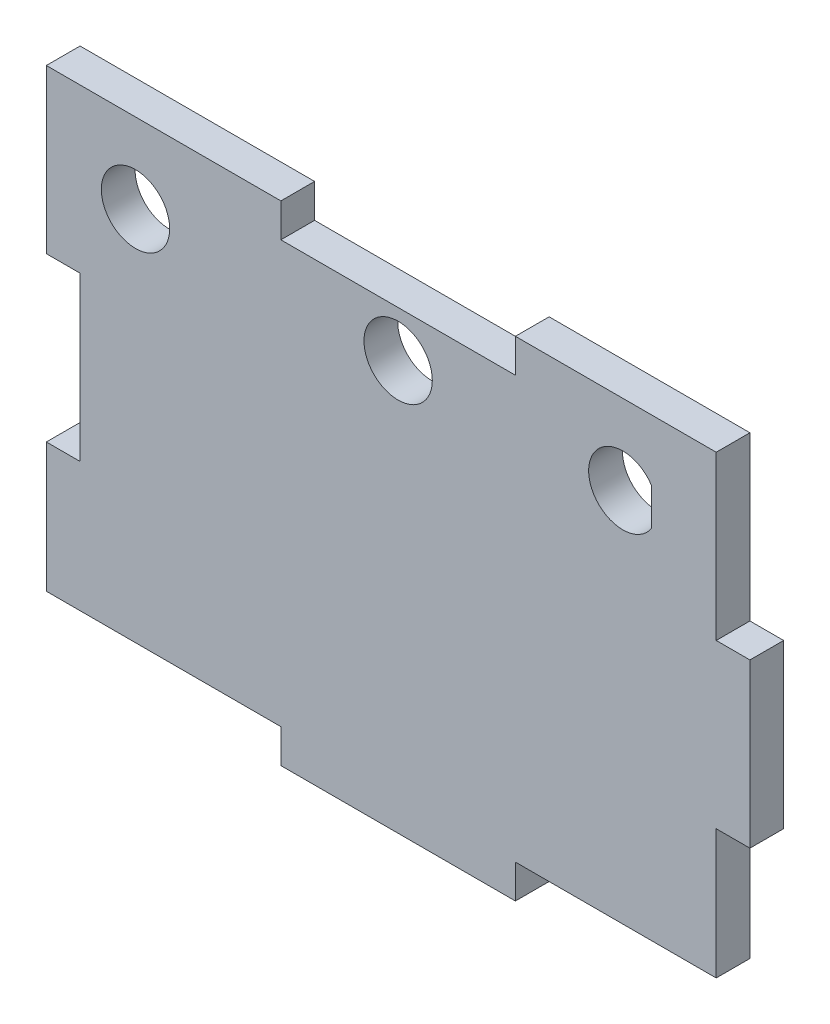
ISO-10303-21;
HEADER;
FILE_DESCRIPTION(('STEP AP214'),'2;1');
FILE_NAME('part.step','',(''),(''),'','','');
FILE_SCHEMA(('AUTOMOTIVE_DESIGN { 1 0 10303 214 1 1 1 1 }'));
ENDSEC;
DATA;
#1=APPLICATION_CONTEXT('core data for automotive mechanical design processes');
#2=APPLICATION_PROTOCOL_DEFINITION('international standard','automotive_design',2000,#1);
#3=PRODUCT_CONTEXT('',#1,'mechanical');
#4=PRODUCT('Part','Part','',(#3));
#5=PRODUCT_RELATED_PRODUCT_CATEGORY('part','',(#4));
#6=PRODUCT_DEFINITION_FORMATION('','',#4);
#7=PRODUCT_DEFINITION_CONTEXT('part definition',#1,'design');
#8=PRODUCT_DEFINITION('design','',#6,#7);
#9=PRODUCT_DEFINITION_SHAPE('','',#8);
#10=(LENGTH_UNIT() NAMED_UNIT(*) SI_UNIT(.MILLI.,.METRE.));
#11=(NAMED_UNIT(*) PLANE_ANGLE_UNIT() SI_UNIT($,.RADIAN.));
#12=(NAMED_UNIT(*) SI_UNIT($,.STERADIAN.) SOLID_ANGLE_UNIT());
#13=UNCERTAINTY_MEASURE_WITH_UNIT(LENGTH_MEASURE(1.E-05),#10,'distance_accuracy_value','');
#14=(GEOMETRIC_REPRESENTATION_CONTEXT(3) GLOBAL_UNCERTAINTY_ASSIGNED_CONTEXT((#13)) GLOBAL_UNIT_ASSIGNED_CONTEXT((#10,
#11,#12)) REPRESENTATION_CONTEXT('',''));
#15=CARTESIAN_POINT('',(0.,0.,0.));
#16=DIRECTION('',(0.,0.,1.));
#17=DIRECTION('',(1.,0.,0.));
#18=AXIS2_PLACEMENT_3D('',#15,#16,#17);
#19=CARTESIAN_POINT('',(60.4012,-41.9862,5.7912));
#20=DIRECTION('',(-1.,0.,0.));
#21=DIRECTION('',(0.,0.,1.));
#22=AXIS2_PLACEMENT_3D('',#19,#20,#21);
#23=PLANE('',#22);
#24=DIRECTION('',(0.,0.,1.));
#25=VECTOR('',#24,1.);
#26=CARTESIAN_POINT('',(60.4011999999999,-13.9954,5.79120000000084));
#27=LINE('',#26,#25);
#28=CARTESIAN_POINT('',(60.4011999999999,-13.9954,8.46545056276682E-13));
#29=VERTEX_POINT('',#28);
#30=CARTESIAN_POINT('',(60.4011999999999,-13.9954,5.79120000000084));
#31=VERTEX_POINT('',#30);
#32=EDGE_CURVE('E217',#29,#31,#27,.T.);
#33=ORIENTED_EDGE('',*,*,#32,.F.);
#34=DIRECTION('',(0.,1.,0.));
#35=VECTOR('',#34,1.);
#36=CARTESIAN_POINT('',(60.4012,-41.9862,0.));
#37=LINE('',#36,#35);
#38=CARTESIAN_POINT('',(60.4012,13.9954,0.));
#39=VERTEX_POINT('',#38);
#40=EDGE_CURVE('E319',#29,#39,#37,.T.);
#41=ORIENTED_EDGE('',*,*,#40,.T.);
#42=DIRECTION('',(0.,0.,-1.));
#43=VECTOR('',#42,1.);
#44=CARTESIAN_POINT('',(60.4011999999999,13.9954,5.79120000000083));
#45=LINE('',#44,#43);
#46=CARTESIAN_POINT('',(60.4011999999999,13.9954,5.79120000000083));
#47=VERTEX_POINT('',#46);
#48=EDGE_CURVE('E215',#47,#39,#45,.T.);
#49=ORIENTED_EDGE('',*,*,#48,.F.);
#50=DIRECTION('',(0.,1.,0.));
#51=VECTOR('',#50,1.);
#52=CARTESIAN_POINT('',(60.4012,-41.9862,5.7912));
#53=LINE('',#52,#51);
#54=EDGE_CURVE('E326',#31,#47,#53,.T.);
#55=ORIENTED_EDGE('',*,*,#54,.F.);
#56=EDGE_LOOP('',(#33,#41,#49,#55));
#57=FACE_BOUND('',#56,.T.);
#58=ADVANCED_FACE('F35',(#57),#23,.F.);
#59=CARTESIAN_POINT('',(-60.4012,41.9862,5.7912));
#60=DIRECTION('',(0.,-1.,0.));
#61=DIRECTION('',(0.,0.,-1.));
#62=AXIS2_PLACEMENT_3D('',#59,#60,#61);
#63=PLANE('',#62);
#64=DIRECTION('',(0.,0.,-1.));
#65=VECTOR('',#64,1.);
#66=CARTESIAN_POINT('',(54.6099999999999,41.9862,5.79120000000082));
#67=LINE('',#66,#65);
#68=CARTESIAN_POINT('',(54.6099999999999,41.9862,5.79120000000082));
#69=VERTEX_POINT('',#68);
#70=CARTESIAN_POINT('',(54.6099999999999,41.9862,0.));
#71=VERTEX_POINT('',#70);
#72=EDGE_CURVE('E238',#69,#71,#67,.T.);
#73=ORIENTED_EDGE('',*,*,#72,.T.);
#74=DIRECTION('',(-1.,0.,0.));
#75=VECTOR('',#74,1.);
#76=CARTESIAN_POINT('',(-60.4012,41.9862,0.));
#77=LINE('',#76,#75);
#78=CARTESIAN_POINT('',(20.1337333333333,41.9862,0.));
#79=VERTEX_POINT('',#78);
#80=EDGE_CURVE('E344',#71,#79,#77,.T.);
#81=ORIENTED_EDGE('',*,*,#80,.T.);
#82=DIRECTION('',(0.,0.,1.));
#83=VECTOR('',#82,1.);
#84=CARTESIAN_POINT('',(20.1337333333333,41.9862,0.));
#85=LINE('',#84,#83);
#86=CARTESIAN_POINT('',(20.1337333333333,41.9862,5.7912));
#87=VERTEX_POINT('',#86);
#88=EDGE_CURVE('E320',#79,#87,#85,.T.);
#89=ORIENTED_EDGE('',*,*,#88,.T.);
#90=DIRECTION('',(-1.,0.,0.));
#91=VECTOR('',#90,1.);
#92=CARTESIAN_POINT('',(-60.4012,41.9862,5.7912));
#93=LINE('',#92,#91);
#94=EDGE_CURVE('E331',#69,#87,#93,.T.);
#95=ORIENTED_EDGE('',*,*,#94,.F.);
#96=EDGE_LOOP('',(#73,#81,#89,#95));
#97=FACE_BOUND('',#96,.T.);
#98=ADVANCED_FACE('F419',(#97),#63,.F.);
#99=CARTESIAN_POINT('',(-60.4012,-41.9862,5.7912));
#100=DIRECTION('',(0.,1.,0.));
#101=DIRECTION('',(0.,0.,1.));
#102=AXIS2_PLACEMENT_3D('',#99,#100,#101);
#103=PLANE('',#102);
#104=DIRECTION('',(0.,0.,1.));
#105=VECTOR('',#104,1.);
#106=CARTESIAN_POINT('',(20.1337333333323,-41.9862000000004,5.791200000001));
#107=LINE('',#106,#105);
#108=CARTESIAN_POINT('',(20.1337333333323,-41.9862000000004,9.95731275210687E-13));
#109=VERTEX_POINT('',#108);
#110=CARTESIAN_POINT('',(20.1337333333323,-41.9862000000004,5.79120000000099));
#111=VERTEX_POINT('',#110);
#112=EDGE_CURVE('E248',#109,#111,#107,.T.);
#113=ORIENTED_EDGE('',*,*,#112,.T.);
#114=DIRECTION('',(1.,0.,0.));
#115=VECTOR('',#114,1.);
#116=CARTESIAN_POINT('',(-60.4012,-41.9862,5.7912));
#117=LINE('',#116,#115);
#118=CARTESIAN_POINT('',(-20.1337333333344,-41.9862000000003,5.79120000000089));
#119=VERTEX_POINT('',#118);
#120=EDGE_CURVE('E337',#119,#111,#117,.T.);
#121=ORIENTED_EDGE('',*,*,#120,.F.);
#122=DIRECTION('',(0.,0.,-1.));
#123=VECTOR('',#122,1.);
#124=CARTESIAN_POINT('',(-20.1337333333344,-41.9862000000003,5.7912000000009));
#125=LINE('',#124,#123);
#126=CARTESIAN_POINT('',(-20.1337333333344,-41.9862000000003,8.98586760555986E-13));
#127=VERTEX_POINT('',#126);
#128=EDGE_CURVE('E244',#119,#127,#125,.T.);
#129=ORIENTED_EDGE('',*,*,#128,.T.);
#130=DIRECTION('',(1.,0.,0.));
#131=VECTOR('',#130,1.);
#132=CARTESIAN_POINT('',(-60.4012,-41.9862,0.));
#133=LINE('',#132,#131);
#134=EDGE_CURVE('E330',#127,#109,#133,.T.);
#135=ORIENTED_EDGE('',*,*,#134,.T.);
#136=EDGE_LOOP('',(#113,#121,#129,#135));
#137=FACE_BOUND('',#136,.T.);
#138=ADVANCED_FACE('F378',(#137),#103,.F.);
#139=CARTESIAN_POINT('',(0.,0.,5.7912));
#140=DIRECTION('',(0.,0.,-1.));
#141=DIRECTION('',(-1.,0.,0.));
#142=AXIS2_PLACEMENT_3D('',#139,#140,#141);
#143=PLANE('',#142);
#144=DIRECTION('',(0.,1.,0.));
#145=VECTOR('',#144,1.);
#146=CARTESIAN_POINT('',(43.4702699731941,31.5383217777612,5.7912));
#147=LINE('',#146,#145);
#148=CARTESIAN_POINT('',(43.4702699731941,25.0516670127841,5.7912));
#149=VERTEX_POINT('',#148);
#150=CARTESIAN_POINT('',(43.4702699731941,31.5383217777612,5.7912));
#151=VERTEX_POINT('',#150);
#152=EDGE_CURVE('E196',#149,#151,#147,.T.);
#153=ORIENTED_EDGE('',*,*,#152,.F.);
#154=CARTESIAN_POINT('',(38.5807699731942,28.2949943952726,5.7912));
#155=DIRECTION('',(0.,0.,1.));
#156=DIRECTION('',(1.,0.,0.));
#157=AXIS2_PLACEMENT_3D('',#154,#155,#156);
#158=CIRCLE('',#157,5.8674);
#159=EDGE_CURVE('E51',#151,#149,#158,.T.);
#160=ORIENTED_EDGE('',*,*,#159,.F.);
#161=EDGE_LOOP('',(#153,#160));
#162=FACE_BOUND('',#161,.T.);
#163=CARTESIAN_POINT('',(0.,28.2949943952726,5.7912));
#164=DIRECTION('',(0.,0.,1.));
#165=DIRECTION('',(1.,0.,0.));
#166=AXIS2_PLACEMENT_3D('',#163,#164,#165);
#167=CIRCLE('',#166,5.86740000000001);
#168=CARTESIAN_POINT('',(5.86740000000001,28.2949943952726,5.7912));
#169=VERTEX_POINT('',#168);
#170=EDGE_CURVE('E201',#169,#169,#167,.T.);
#171=ORIENTED_EDGE('',*,*,#170,.F.);
#172=EDGE_LOOP('',(#171));
#173=FACE_BOUND('',#172,.T.);
#174=CARTESIAN_POINT('',(-45.0952822175168,28.2949943952726,5.7912));
#175=DIRECTION('',(0.,0.,1.));
#176=DIRECTION('',(1.,0.,0.));
#177=AXIS2_PLACEMENT_3D('',#174,#175,#176);
#178=CIRCLE('',#177,5.8674);
#179=CARTESIAN_POINT('',(-39.2278822175168,28.2949943952726,5.7912));
#180=VERTEX_POINT('',#179);
#181=EDGE_CURVE('E206',#180,#180,#178,.T.);
#182=ORIENTED_EDGE('',*,*,#181,.F.);
#183=EDGE_LOOP('',(#182));
#184=FACE_BOUND('',#183,.T.);
#185=DIRECTION('',(0.,-1.,0.));
#186=VECTOR('',#185,1.);
#187=CARTESIAN_POINT('',(-60.4012,-41.9862,5.7912));
#188=LINE('',#187,#186);
#189=CARTESIAN_POINT('',(-60.4012,-13.9954,5.7912));
#190=VERTEX_POINT('',#189);
#191=CARTESIAN_POINT('',(-60.401200000001,-36.1950000000002,5.79119999999999));
#192=VERTEX_POINT('',#191);
#193=EDGE_CURVE('E333',#190,#192,#188,.T.);
#194=ORIENTED_EDGE('',*,*,#193,.T.);
#195=DIRECTION('',(1.,0.,0.));
#196=VECTOR('',#195,1.);
#197=CARTESIAN_POINT('',(-1.010891891029E-13,-36.1950000000004,5.7912));
#198=LINE('',#197,#196);
#199=CARTESIAN_POINT('',(-20.1337333333344,-36.1950000000003,5.79120000000089));
#200=VERTEX_POINT('',#199);
#201=EDGE_CURVE('E271',#192,#200,#198,.T.);
#202=ORIENTED_EDGE('',*,*,#201,.T.);
#203=DIRECTION('',(0.,-1.,0.));
#204=VECTOR('',#203,1.);
#205=CARTESIAN_POINT('',(-20.1337333333344,-36.1950000000003,5.7912000000009));
#206=LINE('',#205,#204);
#207=EDGE_CURVE('E251',#200,#119,#206,.T.);
#208=ORIENTED_EDGE('',*,*,#207,.T.);
#209=ORIENTED_EDGE('',*,*,#120,.T.);
#210=DIRECTION('',(0.,-1.,0.));
#211=VECTOR('',#210,1.);
#212=CARTESIAN_POINT('',(20.1337333333323,-36.1950000000004,5.791200000001));
#213=LINE('',#212,#211);
#214=CARTESIAN_POINT('',(20.1337333333323,-36.1950000000004,5.791200000001));
#215=VERTEX_POINT('',#214);
#216=EDGE_CURVE('E256',#215,#111,#213,.T.);
#217=ORIENTED_EDGE('',*,*,#216,.F.);
#218=CARTESIAN_POINT('',(54.61,-36.1950000000005,5.79119999999886));
#219=VERTEX_POINT('',#218);
#220=EDGE_CURVE('E268',#215,#219,#198,.T.);
#221=ORIENTED_EDGE('',*,*,#220,.T.);
#222=DIRECTION('',(0.,1.,0.));
#223=VECTOR('',#222,1.);
#224=CARTESIAN_POINT('',(54.6099999999999,41.9862,5.79120000000082));
#225=LINE('',#224,#223);
#226=CARTESIAN_POINT('',(54.6099999999999,-13.9954,5.79120000000083));
#227=VERTEX_POINT('',#226);
#228=EDGE_CURVE('E235',#219,#227,#225,.T.);
#229=ORIENTED_EDGE('',*,*,#228,.T.);
#230=DIRECTION('',(-1.,0.,0.));
#231=VECTOR('',#230,1.);
#232=CARTESIAN_POINT('',(60.4011999999999,-13.9954,5.79120000000084));
#233=LINE('',#232,#231);
#234=EDGE_CURVE('E224',#31,#227,#233,.T.);
#235=ORIENTED_EDGE('',*,*,#234,.F.);
#236=ORIENTED_EDGE('',*,*,#54,.T.);
#237=DIRECTION('',(-1.,0.,0.));
#238=VECTOR('',#237,1.);
#239=CARTESIAN_POINT('',(60.4011999999999,13.9954,5.79120000000083));
#240=LINE('',#239,#238);
#241=CARTESIAN_POINT('',(54.6099999999999,13.9954,5.79120000000082));
#242=VERTEX_POINT('',#241);
#243=EDGE_CURVE('E220',#47,#242,#240,.T.);
#244=ORIENTED_EDGE('',*,*,#243,.T.);
#245=EDGE_CURVE('E227',#242,#69,#225,.T.);
#246=ORIENTED_EDGE('',*,*,#245,.T.);
#247=ORIENTED_EDGE('',*,*,#94,.T.);
#248=DIRECTION('',(0.,1.,0.));
#249=VECTOR('',#248,1.);
#250=CARTESIAN_POINT('',(20.1337333333333,41.9862,5.7912));
#251=LINE('',#250,#249);
#252=CARTESIAN_POINT('',(20.1337333333333,36.195,5.7912));
#253=VERTEX_POINT('',#252);
#254=EDGE_CURVE('E303',#253,#87,#251,.T.);
#255=ORIENTED_EDGE('',*,*,#254,.F.);
#256=DIRECTION('',(1.,0.,0.));
#257=VECTOR('',#256,1.);
#258=CARTESIAN_POINT('',(-20.1337333333333,36.195,5.7912));
#259=LINE('',#258,#257);
#260=CARTESIAN_POINT('',(-20.1337333333333,36.195,5.7912));
#261=VERTEX_POINT('',#260);
#262=EDGE_CURVE('E312',#261,#253,#259,.T.);
#263=ORIENTED_EDGE('',*,*,#262,.F.);
#264=DIRECTION('',(0.,-1.,0.));
#265=VECTOR('',#264,1.);
#266=CARTESIAN_POINT('',(-20.1337333333333,41.9862,5.7912));
#267=LINE('',#266,#265);
#268=CARTESIAN_POINT('',(-20.1337333333333,41.9862,5.7912));
#269=VERTEX_POINT('',#268);
#270=EDGE_CURVE('E293',#269,#261,#267,.T.);
#271=ORIENTED_EDGE('',*,*,#270,.F.);
#272=CARTESIAN_POINT('',(-60.4012,41.9862,5.7912));
#273=VERTEX_POINT('',#272);
#274=EDGE_CURVE('E329',#269,#273,#93,.T.);
#275=ORIENTED_EDGE('',*,*,#274,.T.);
#276=CARTESIAN_POINT('',(-60.4012,13.9954,5.7912));
#277=VERTEX_POINT('',#276);
#278=EDGE_CURVE('E334',#273,#277,#188,.T.);
#279=ORIENTED_EDGE('',*,*,#278,.T.);
#280=DIRECTION('',(-1.,0.,0.));
#281=VECTOR('',#280,1.);
#282=CARTESIAN_POINT('',(-60.4012,13.9954,5.7912));
#283=LINE('',#282,#281);
#284=CARTESIAN_POINT('',(-54.61,13.9954,5.7912));
#285=VERTEX_POINT('',#284);
#286=EDGE_CURVE('E276',#285,#277,#283,.T.);
#287=ORIENTED_EDGE('',*,*,#286,.F.);
#288=DIRECTION('',(0.,1.,0.));
#289=VECTOR('',#288,1.);
#290=CARTESIAN_POINT('',(-54.61,13.9954,5.7912));
#291=LINE('',#290,#289);
#292=CARTESIAN_POINT('',(-54.61,-13.9954,5.7912));
#293=VERTEX_POINT('',#292);
#294=EDGE_CURVE('E286',#293,#285,#291,.T.);
#295=ORIENTED_EDGE('',*,*,#294,.F.);
#296=DIRECTION('',(1.,0.,0.));
#297=VECTOR('',#296,1.);
#298=CARTESIAN_POINT('',(-60.4012,-13.9954,5.7912));
#299=LINE('',#298,#297);
#300=EDGE_CURVE('E283',#190,#293,#299,.T.);
#301=ORIENTED_EDGE('',*,*,#300,.F.);
#302=EDGE_LOOP('',(#194,#202,#208,#209,#217,#221,#229,#235,#236,#244,#246,#247,#255,#263,#271,
#275,#279,#287,#295,#301));
#303=FACE_BOUND('',#302,.T.);
#304=ADVANCED_FACE('F382',(#162,#173,#184,#303),#143,.F.);
#305=CARTESIAN_POINT('',(0.,0.,0.));
#306=DIRECTION('',(0.,0.,-1.));
#307=DIRECTION('',(-1.,0.,0.));
#308=AXIS2_PLACEMENT_3D('',#305,#306,#307);
#309=PLANE('',#308);
#310=CARTESIAN_POINT('',(38.5807699731942,28.2949943952726,0.));
#311=DIRECTION('',(0.,0.,1.));
#312=DIRECTION('',(1.,0.,0.));
#313=AXIS2_PLACEMENT_3D('',#310,#311,#312);
#314=CIRCLE('',#313,5.8674);
#315=CARTESIAN_POINT('',(43.4702699731941,31.5383217777612,0.));
#316=VERTEX_POINT('',#315);
#317=CARTESIAN_POINT('',(43.4702699731941,25.0516670127841,0.));
#318=VERTEX_POINT('',#317);
#319=EDGE_CURVE('E56',#316,#318,#314,.T.);
#320=ORIENTED_EDGE('',*,*,#319,.T.);
#321=DIRECTION('',(0.,1.,0.));
#322=VECTOR('',#321,1.);
#323=CARTESIAN_POINT('',(43.4702699731941,31.5383217777612,0.));
#324=LINE('',#323,#322);
#325=EDGE_CURVE('E188',#318,#316,#324,.T.);
#326=ORIENTED_EDGE('',*,*,#325,.T.);
#327=EDGE_LOOP('',(#320,#326));
#328=FACE_BOUND('',#327,.T.);
#329=CARTESIAN_POINT('',(0.,28.2949943952726,0.));
#330=DIRECTION('',(0.,0.,1.));
#331=DIRECTION('',(1.,0.,0.));
#332=AXIS2_PLACEMENT_3D('',#329,#330,#331);
#333=CIRCLE('',#332,5.86740000000001);
#334=CARTESIAN_POINT('',(5.86740000000001,28.2949943952726,0.));
#335=VERTEX_POINT('',#334);
#336=EDGE_CURVE('E203',#335,#335,#333,.T.);
#337=ORIENTED_EDGE('',*,*,#336,.T.);
#338=EDGE_LOOP('',(#337));
#339=FACE_BOUND('',#338,.T.);
#340=CARTESIAN_POINT('',(-45.0952822175168,28.2949943952726,0.));
#341=DIRECTION('',(0.,0.,1.));
#342=DIRECTION('',(1.,0.,0.));
#343=AXIS2_PLACEMENT_3D('',#340,#341,#342);
#344=CIRCLE('',#343,5.8674);
#345=CARTESIAN_POINT('',(-39.2278822175168,28.2949943952726,0.));
#346=VERTEX_POINT('',#345);
#347=EDGE_CURVE('E209',#346,#346,#344,.T.);
#348=ORIENTED_EDGE('',*,*,#347,.T.);
#349=EDGE_LOOP('',(#348));
#350=FACE_BOUND('',#349,.T.);
#351=ORIENTED_EDGE('',*,*,#40,.F.);
#352=DIRECTION('',(-1.,0.,0.));
#353=VECTOR('',#352,1.);
#354=CARTESIAN_POINT('',(60.4011999999999,-13.9954,8.46545056276682E-13));
#355=LINE('',#354,#353);
#356=CARTESIAN_POINT('',(54.6099999999999,-13.9954,0.));
#357=VERTEX_POINT('',#356);
#358=EDGE_CURVE('E228',#29,#357,#355,.T.);
#359=ORIENTED_EDGE('',*,*,#358,.T.);
#360=DIRECTION('',(0.,-1.,0.));
#361=VECTOR('',#360,1.);
#362=CARTESIAN_POINT('',(54.6099999999999,0.,0.));
#363=LINE('',#362,#361);
#364=CARTESIAN_POINT('',(54.61,-36.1950000000005,0.));
#365=VERTEX_POINT('',#364);
#366=EDGE_CURVE('E44',#357,#365,#363,.T.);
#367=ORIENTED_EDGE('',*,*,#366,.T.);
#368=DIRECTION('',(1.,0.,0.));
#369=VECTOR('',#368,1.);
#370=CARTESIAN_POINT('',(-1.010891891029E-13,-36.1950000000004,0.));
#371=LINE('',#370,#369);
#372=CARTESIAN_POINT('',(20.1337333333323,-36.1950000000004,9.95731275210687E-13));
#373=VERTEX_POINT('',#372);
#374=EDGE_CURVE('E38',#373,#365,#371,.T.);
#375=ORIENTED_EDGE('',*,*,#374,.F.);
#376=DIRECTION('',(0.,-1.,0.));
#377=VECTOR('',#376,1.);
#378=CARTESIAN_POINT('',(20.1337333333323,-36.1950000000004,9.95731275210687E-13));
#379=LINE('',#378,#377);
#380=EDGE_CURVE('E259',#373,#109,#379,.T.);
#381=ORIENTED_EDGE('',*,*,#380,.T.);
#382=ORIENTED_EDGE('',*,*,#134,.F.);
#383=DIRECTION('',(0.,-1.,0.));
#384=VECTOR('',#383,1.);
#385=CARTESIAN_POINT('',(-20.1337333333343,-36.1950000000003,8.98586760555986E-13));
#386=LINE('',#385,#384);
#387=CARTESIAN_POINT('',(-20.1337333333343,-36.1950000000003,0.));
#388=VERTEX_POINT('',#387);
#389=EDGE_CURVE('E262',#388,#127,#386,.T.);
#390=ORIENTED_EDGE('',*,*,#389,.F.);
#391=CARTESIAN_POINT('',(-60.401200000001,-36.1950000000002,0.));
#392=VERTEX_POINT('',#391);
#393=EDGE_CURVE('E43',#392,#388,#371,.T.);
#394=ORIENTED_EDGE('',*,*,#393,.F.);
#395=DIRECTION('',(0.,-1.,0.));
#396=VECTOR('',#395,1.);
#397=CARTESIAN_POINT('',(-60.4012,-41.9862,0.));
#398=LINE('',#397,#396);
#399=CARTESIAN_POINT('',(-60.4012,-13.9954,0.));
#400=VERTEX_POINT('',#399);
#401=EDGE_CURVE('E346',#400,#392,#398,.T.);
#402=ORIENTED_EDGE('',*,*,#401,.F.);
#403=DIRECTION('',(1.,0.,0.));
#404=VECTOR('',#403,1.);
#405=CARTESIAN_POINT('',(-60.4012,-13.9954,0.));
#406=LINE('',#405,#404);
#407=CARTESIAN_POINT('',(-54.61,-13.9954,0.));
#408=VERTEX_POINT('',#407);
#409=EDGE_CURVE('E272',#400,#408,#406,.T.);
#410=ORIENTED_EDGE('',*,*,#409,.T.);
#411=DIRECTION('',(0.,1.,0.));
#412=VECTOR('',#411,1.);
#413=CARTESIAN_POINT('',(-54.61,13.9954,0.));
#414=LINE('',#413,#412);
#415=CARTESIAN_POINT('',(-54.61,13.9954,0.));
#416=VERTEX_POINT('',#415);
#417=EDGE_CURVE('E275',#408,#416,#414,.T.);
#418=ORIENTED_EDGE('',*,*,#417,.T.);
#419=DIRECTION('',(-1.,0.,0.));
#420=VECTOR('',#419,1.);
#421=CARTESIAN_POINT('',(-60.4012,13.9954,0.));
#422=LINE('',#421,#420);
#423=CARTESIAN_POINT('',(-60.4012,13.9954,0.));
#424=VERTEX_POINT('',#423);
#425=EDGE_CURVE('E279',#416,#424,#422,.T.);
#426=ORIENTED_EDGE('',*,*,#425,.T.);
#427=CARTESIAN_POINT('',(-60.4012,41.9862,0.));
#428=VERTEX_POINT('',#427);
#429=EDGE_CURVE('E347',#428,#424,#398,.T.);
#430=ORIENTED_EDGE('',*,*,#429,.F.);
#431=CARTESIAN_POINT('',(-20.1337333333333,41.9862,0.));
#432=VERTEX_POINT('',#431);
#433=EDGE_CURVE('E343',#432,#428,#77,.T.);
#434=ORIENTED_EDGE('',*,*,#433,.F.);
#435=DIRECTION('',(0.,-1.,0.));
#436=VECTOR('',#435,1.);
#437=CARTESIAN_POINT('',(-20.1337333333333,41.9862,0.));
#438=LINE('',#437,#436);
#439=CARTESIAN_POINT('',(-20.1337333333333,36.195,0.));
#440=VERTEX_POINT('',#439);
#441=EDGE_CURVE('E299',#432,#440,#438,.T.);
#442=ORIENTED_EDGE('',*,*,#441,.T.);
#443=DIRECTION('',(1.,0.,0.));
#444=VECTOR('',#443,1.);
#445=CARTESIAN_POINT('',(-20.1337333333333,36.195,0.));
#446=LINE('',#445,#444);
#447=CARTESIAN_POINT('',(20.1337333333333,36.195,0.));
#448=VERTEX_POINT('',#447);
#449=EDGE_CURVE('E302',#440,#448,#446,.T.);
#450=ORIENTED_EDGE('',*,*,#449,.T.);
#451=DIRECTION('',(0.,1.,0.));
#452=VECTOR('',#451,1.);
#453=CARTESIAN_POINT('',(20.1337333333333,41.9862,0.));
#454=LINE('',#453,#452);
#455=EDGE_CURVE('E306',#448,#79,#454,.T.);
#456=ORIENTED_EDGE('',*,*,#455,.T.);
#457=ORIENTED_EDGE('',*,*,#80,.F.);
#458=CARTESIAN_POINT('',(54.6099999999999,13.9954,8.32667268468867E-13));
#459=VERTEX_POINT('',#458);
#460=EDGE_CURVE('E11',#71,#459,#363,.T.);
#461=ORIENTED_EDGE('',*,*,#460,.T.);
#462=DIRECTION('',(-1.,0.,0.));
#463=VECTOR('',#462,1.);
#464=CARTESIAN_POINT('',(60.4011999999999,13.9954,8.46545056276682E-13));
#465=LINE('',#464,#463);
#466=EDGE_CURVE('E231',#39,#459,#465,.T.);
#467=ORIENTED_EDGE('',*,*,#466,.F.);
#468=EDGE_LOOP('',(#351,#359,#367,#375,#381,#382,#390,#394,#402,#410,#418,#426,#430,#434,#442,
#450,#456,#457,#461,#467));
#469=FACE_BOUND('',#468,.T.);
#470=ADVANCED_FACE('F194',(#328,#339,#350,#469),#309,.T.);
#471=CARTESIAN_POINT('',(-60.4012,-41.9862,5.7912));
#472=DIRECTION('',(1.,0.,0.));
#473=DIRECTION('',(0.,0.,-1.));
#474=AXIS2_PLACEMENT_3D('',#471,#472,#473);
#475=PLANE('',#474);
#476=ORIENTED_EDGE('',*,*,#429,.T.);
#477=DIRECTION('',(0.,0.,1.));
#478=VECTOR('',#477,1.);
#479=CARTESIAN_POINT('',(-60.4012,13.9954,0.));
#480=LINE('',#479,#478);
#481=EDGE_CURVE('E290',#424,#277,#480,.T.);
#482=ORIENTED_EDGE('',*,*,#481,.T.);
#483=ORIENTED_EDGE('',*,*,#278,.F.);
#484=DIRECTION('',(0.,0.,-1.));
#485=VECTOR('',#484,1.);
#486=CARTESIAN_POINT('',(-60.4012,41.9862,5.7912));
#487=LINE('',#486,#485);
#488=EDGE_CURVE('E340',#273,#428,#487,.T.);
#489=ORIENTED_EDGE('',*,*,#488,.T.);
#490=EDGE_LOOP('',(#476,#482,#483,#489));
#491=FACE_BOUND('',#490,.T.);
#492=ADVANCED_FACE('F399',(#491),#475,.F.);
#493=ORIENTED_EDGE('',*,*,#274,.F.);
#494=DIRECTION('',(0.,0.,1.));
#495=VECTOR('',#494,1.);
#496=CARTESIAN_POINT('',(-20.1337333333333,41.9862,0.));
#497=LINE('',#496,#495);
#498=EDGE_CURVE('E317',#432,#269,#497,.T.);
#499=ORIENTED_EDGE('',*,*,#498,.F.);
#500=ORIENTED_EDGE('',*,*,#433,.T.);
#501=ORIENTED_EDGE('',*,*,#488,.F.);
#502=EDGE_LOOP('',(#493,#499,#500,#501));
#503=FACE_BOUND('',#502,.T.);
#504=ADVANCED_FACE('F405',(#503),#63,.F.);
#505=ORIENTED_EDGE('',*,*,#401,.T.);
#506=DIRECTION('',(0.,0.,1.));
#507=VECTOR('',#506,1.);
#508=CARTESIAN_POINT('',(-60.401200000001,-36.1950000000002,-23.8251999999992));
#509=LINE('',#508,#507);
#510=EDGE_CURVE('E258',#392,#192,#509,.T.);
#511=ORIENTED_EDGE('',*,*,#510,.T.);
#512=ORIENTED_EDGE('',*,*,#193,.F.);
#513=DIRECTION('',(0.,0.,1.));
#514=VECTOR('',#513,1.);
#515=CARTESIAN_POINT('',(-60.4012,-13.9954,0.));
#516=LINE('',#515,#514);
#517=EDGE_CURVE('E282',#400,#190,#516,.T.);
#518=ORIENTED_EDGE('',*,*,#517,.F.);
#519=EDGE_LOOP('',(#505,#511,#512,#518));
#520=FACE_BOUND('',#519,.T.);
#521=ADVANCED_FACE('F386',(#520),#475,.F.);
#522=CARTESIAN_POINT('',(-20.1337333333333,41.9862,0.));
#523=DIRECTION('',(-1.,0.,0.));
#524=DIRECTION('',(0.,0.,1.));
#525=AXIS2_PLACEMENT_3D('',#522,#523,#524);
#526=PLANE('',#525);
#527=ORIENTED_EDGE('',*,*,#270,.T.);
#528=DIRECTION('',(0.,0.,1.));
#529=VECTOR('',#528,1.);
#530=CARTESIAN_POINT('',(-20.1337333333333,36.195,0.));
#531=LINE('',#530,#529);
#532=EDGE_CURVE('E309',#440,#261,#531,.T.);
#533=ORIENTED_EDGE('',*,*,#532,.F.);
#534=ORIENTED_EDGE('',*,*,#441,.F.);
#535=ORIENTED_EDGE('',*,*,#498,.T.);
#536=EDGE_LOOP('',(#527,#533,#534,#535));
#537=FACE_BOUND('',#536,.T.);
#538=ADVANCED_FACE('F408',(#537),#526,.F.);
#539=CARTESIAN_POINT('',(20.1337333333333,41.9862,0.));
#540=DIRECTION('',(1.,0.,0.));
#541=DIRECTION('',(0.,1.,0.));
#542=AXIS2_PLACEMENT_3D('',#539,#540,#541);
#543=PLANE('',#542);
#544=ORIENTED_EDGE('',*,*,#254,.T.);
#545=ORIENTED_EDGE('',*,*,#88,.F.);
#546=ORIENTED_EDGE('',*,*,#455,.F.);
#547=DIRECTION('',(0.,0.,1.));
#548=VECTOR('',#547,1.);
#549=CARTESIAN_POINT('',(20.1337333333333,36.195,0.));
#550=LINE('',#549,#548);
#551=EDGE_CURVE('E323',#448,#253,#550,.T.);
#552=ORIENTED_EDGE('',*,*,#551,.T.);
#553=EDGE_LOOP('',(#544,#545,#546,#552));
#554=FACE_BOUND('',#553,.T.);
#555=ADVANCED_FACE('F414',(#554),#543,.F.);
#556=CARTESIAN_POINT('',(-20.1337333333333,36.195,0.));
#557=DIRECTION('',(0.,-1.,0.));
#558=DIRECTION('',(1.,0.,0.));
#559=AXIS2_PLACEMENT_3D('',#556,#557,#558);
#560=PLANE('',#559);
#561=ORIENTED_EDGE('',*,*,#262,.T.);
#562=ORIENTED_EDGE('',*,*,#551,.F.);
#563=ORIENTED_EDGE('',*,*,#449,.F.);
#564=ORIENTED_EDGE('',*,*,#532,.T.);
#565=EDGE_LOOP('',(#561,#562,#563,#564));
#566=FACE_BOUND('',#565,.T.);
#567=ADVANCED_FACE('F411',(#566),#560,.F.);
#568=CARTESIAN_POINT('',(-60.4012,13.9954,0.));
#569=DIRECTION('',(0.,1.,0.));
#570=DIRECTION('',(0.,0.,1.));
#571=AXIS2_PLACEMENT_3D('',#568,#569,#570);
#572=PLANE('',#571);
#573=ORIENTED_EDGE('',*,*,#286,.T.);
#574=ORIENTED_EDGE('',*,*,#481,.F.);
#575=ORIENTED_EDGE('',*,*,#425,.F.);
#576=DIRECTION('',(0.,0.,1.));
#577=VECTOR('',#576,1.);
#578=CARTESIAN_POINT('',(-54.61,13.9954,0.));
#579=LINE('',#578,#577);
#580=EDGE_CURVE('E294',#416,#285,#579,.T.);
#581=ORIENTED_EDGE('',*,*,#580,.T.);
#582=EDGE_LOOP('',(#573,#574,#575,#581));
#583=FACE_BOUND('',#582,.T.);
#584=ADVANCED_FACE('F397',(#583),#572,.F.);
#585=CARTESIAN_POINT('',(-54.61,13.9954,0.));
#586=DIRECTION('',(1.,0.,0.));
#587=DIRECTION('',(0.,1.,0.));
#588=AXIS2_PLACEMENT_3D('',#585,#586,#587);
#589=PLANE('',#588);
#590=ORIENTED_EDGE('',*,*,#294,.T.);
#591=ORIENTED_EDGE('',*,*,#580,.F.);
#592=ORIENTED_EDGE('',*,*,#417,.F.);
#593=DIRECTION('',(0.,0.,1.));
#594=VECTOR('',#593,1.);
#595=CARTESIAN_POINT('',(-54.61,-13.9954,0.));
#596=LINE('',#595,#594);
#597=EDGE_CURVE('E296',#408,#293,#596,.T.);
#598=ORIENTED_EDGE('',*,*,#597,.T.);
#599=EDGE_LOOP('',(#590,#591,#592,#598));
#600=FACE_BOUND('',#599,.T.);
#601=ADVANCED_FACE('F393',(#600),#589,.F.);
#602=CARTESIAN_POINT('',(-60.4012,-13.9954,0.));
#603=DIRECTION('',(0.,-1.,0.));
#604=DIRECTION('',(0.,0.,-1.));
#605=AXIS2_PLACEMENT_3D('',#602,#603,#604);
#606=PLANE('',#605);
#607=ORIENTED_EDGE('',*,*,#300,.T.);
#608=ORIENTED_EDGE('',*,*,#597,.F.);
#609=ORIENTED_EDGE('',*,*,#409,.F.);
#610=ORIENTED_EDGE('',*,*,#517,.T.);
#611=EDGE_LOOP('',(#607,#608,#609,#610));
#612=FACE_BOUND('',#611,.T.);
#613=ADVANCED_FACE('F390',(#612),#606,.F.);
#614=CARTESIAN_POINT('',(60.4011999999999,13.9954,5.79120000000083));
#615=DIRECTION('',(0.,1.,0.));
#616=DIRECTION('',(1.,0.,0.));
#617=AXIS2_PLACEMENT_3D('',#614,#615,#616);
#618=PLANE('',#617);
#619=DIRECTION('',(0.,0.,-1.));
#620=VECTOR('',#619,1.);
#621=CARTESIAN_POINT('',(54.6099999999999,13.9954,5.79120000000082));
#622=LINE('',#621,#620);
#623=EDGE_CURVE('E212',#242,#459,#622,.T.);
#624=ORIENTED_EDGE('',*,*,#623,.F.);
#625=ORIENTED_EDGE('',*,*,#243,.F.);
#626=ORIENTED_EDGE('',*,*,#48,.T.);
#627=ORIENTED_EDGE('',*,*,#466,.T.);
#628=EDGE_LOOP('',(#624,#625,#626,#627));
#629=FACE_BOUND('',#628,.T.);
#630=ADVANCED_FACE('F429',(#629),#618,.T.);
#631=CARTESIAN_POINT('',(54.61,0.,-59.1819999999992));
#632=DIRECTION('',(1.,0.,0.));
#633=DIRECTION('',(0.,0.,1.));
#634=AXIS2_PLACEMENT_3D('',#631,#632,#633);
#635=PLANE('',#634);
#636=ORIENTED_EDGE('',*,*,#72,.F.);
#637=ORIENTED_EDGE('',*,*,#245,.F.);
#638=ORIENTED_EDGE('',*,*,#623,.T.);
#639=ORIENTED_EDGE('',*,*,#460,.F.);
#640=EDGE_LOOP('',(#636,#637,#638,#639));
#641=FACE_BOUND('',#640,.T.);
#642=ADVANCED_FACE('F424',(#641),#635,.T.);
#643=CARTESIAN_POINT('',(60.4011999999999,-13.9954,5.79120000000084));
#644=DIRECTION('',(0.,-1.,0.));
#645=DIRECTION('',(-1.,0.,0.));
#646=AXIS2_PLACEMENT_3D('',#643,#644,#645);
#647=PLANE('',#646);
#648=DIRECTION('',(0.,0.,1.));
#649=VECTOR('',#648,1.);
#650=CARTESIAN_POINT('',(54.6099999999999,-13.9954,5.79120000000083));
#651=LINE('',#650,#649);
#652=EDGE_CURVE('E218',#357,#227,#651,.T.);
#653=ORIENTED_EDGE('',*,*,#652,.F.);
#654=ORIENTED_EDGE('',*,*,#358,.F.);
#655=ORIENTED_EDGE('',*,*,#32,.T.);
#656=ORIENTED_EDGE('',*,*,#234,.T.);
#657=EDGE_LOOP('',(#653,#654,#655,#656));
#658=FACE_BOUND('',#657,.T.);
#659=ADVANCED_FACE('F433',(#658),#647,.T.);
#660=ORIENTED_EDGE('',*,*,#652,.T.);
#661=ORIENTED_EDGE('',*,*,#228,.F.);
#662=DIRECTION('',(0.,0.,-1.));
#663=VECTOR('',#662,1.);
#664=CARTESIAN_POINT('',(54.6100000000001,-36.1950000000005,-9.01699999999892));
#665=LINE('',#664,#663);
#666=EDGE_CURVE('E241',#219,#365,#665,.T.);
#667=ORIENTED_EDGE('',*,*,#666,.T.);
#668=ORIENTED_EDGE('',*,*,#366,.F.);
#669=EDGE_LOOP('',(#660,#661,#667,#668));
#670=FACE_BOUND('',#669,.T.);
#671=ADVANCED_FACE('F436',(#670),#635,.T.);
#672=CARTESIAN_POINT('',(20.1337333333323,-36.1950000000004,5.791200000001));
#673=DIRECTION('',(1.,0.,0.));
#674=DIRECTION('',(0.,-1.,0.));
#675=AXIS2_PLACEMENT_3D('',#672,#673,#674);
#676=PLANE('',#675);
#677=ORIENTED_EDGE('',*,*,#112,.F.);
#678=ORIENTED_EDGE('',*,*,#380,.F.);
#679=DIRECTION('',(0.,0.,1.));
#680=VECTOR('',#679,1.);
#681=CARTESIAN_POINT('',(20.1337333333323,-36.1950000000004,5.791200000001));
#682=LINE('',#681,#680);
#683=EDGE_CURVE('E247',#373,#215,#682,.T.);
#684=ORIENTED_EDGE('',*,*,#683,.T.);
#685=ORIENTED_EDGE('',*,*,#216,.T.);
#686=EDGE_LOOP('',(#677,#678,#684,#685));
#687=FACE_BOUND('',#686,.T.);
#688=ADVANCED_FACE('F439',(#687),#676,.T.);
#689=CARTESIAN_POINT('',(-9.96904239713991E-13,-36.1950000000004,-9.01699999999905));
#690=DIRECTION('',(0.,1.,0.));
#691=DIRECTION('',(0.,0.,-1.));
#692=AXIS2_PLACEMENT_3D('',#689,#690,#691);
#693=PLANE('',#692);
#694=ORIENTED_EDGE('',*,*,#683,.F.);
#695=ORIENTED_EDGE('',*,*,#374,.T.);
#696=ORIENTED_EDGE('',*,*,#666,.F.);
#697=ORIENTED_EDGE('',*,*,#220,.F.);
#698=EDGE_LOOP('',(#694,#695,#696,#697));
#699=FACE_BOUND('',#698,.T.);
#700=ADVANCED_FACE('F437',(#699),#693,.F.);
#701=ORIENTED_EDGE('',*,*,#510,.F.);
#702=ORIENTED_EDGE('',*,*,#393,.T.);
#703=DIRECTION('',(0.,0.,-1.));
#704=VECTOR('',#703,1.);
#705=CARTESIAN_POINT('',(-20.1337333333344,-36.1950000000003,5.7912000000009));
#706=LINE('',#705,#704);
#707=EDGE_CURVE('E245',#200,#388,#706,.T.);
#708=ORIENTED_EDGE('',*,*,#707,.F.);
#709=ORIENTED_EDGE('',*,*,#201,.F.);
#710=EDGE_LOOP('',(#701,#702,#708,#709));
#711=FACE_BOUND('',#710,.T.);
#712=ADVANCED_FACE('F368',(#711),#693,.F.);
#713=CARTESIAN_POINT('',(-20.1337333333344,-36.1950000000003,5.7912000000009));
#714=DIRECTION('',(-1.,0.,0.));
#715=DIRECTION('',(0.,1.,0.));
#716=AXIS2_PLACEMENT_3D('',#713,#714,#715);
#717=PLANE('',#716);
#718=ORIENTED_EDGE('',*,*,#128,.F.);
#719=ORIENTED_EDGE('',*,*,#207,.F.);
#720=ORIENTED_EDGE('',*,*,#707,.T.);
#721=ORIENTED_EDGE('',*,*,#389,.T.);
#722=EDGE_LOOP('',(#718,#719,#720,#721));
#723=FACE_BOUND('',#722,.T.);
#724=ADVANCED_FACE('F375',(#723),#717,.T.);
#725=CARTESIAN_POINT('',(-45.0952822175168,28.2949943952726,0.));
#726=DIRECTION('',(0.,0.,1.));
#727=DIRECTION('',(1.,0.,0.));
#728=AXIS2_PLACEMENT_3D('',#725,#726,#727);
#729=CYLINDRICAL_SURFACE('',#728,5.8674);
#730=ORIENTED_EDGE('',*,*,#347,.F.);
#731=EDGE_LOOP('',(#730));
#732=FACE_BOUND('',#731,.T.);
#733=ORIENTED_EDGE('',*,*,#181,.T.);
#734=EDGE_LOOP('',(#733));
#735=FACE_BOUND('',#734,.T.);
#736=ADVANCED_FACE('F485',(#732,#735),#729,.F.);
#737=CARTESIAN_POINT('',(0.,28.2949943952726,0.));
#738=DIRECTION('',(0.,0.,1.));
#739=DIRECTION('',(1.,0.,0.));
#740=AXIS2_PLACEMENT_3D('',#737,#738,#739);
#741=CYLINDRICAL_SURFACE('',#740,5.86740000000001);
#742=ORIENTED_EDGE('',*,*,#336,.F.);
#743=EDGE_LOOP('',(#742));
#744=FACE_BOUND('',#743,.T.);
#745=ORIENTED_EDGE('',*,*,#170,.T.);
#746=EDGE_LOOP('',(#745));
#747=FACE_BOUND('',#746,.T.);
#748=ADVANCED_FACE('F489',(#744,#747),#741,.F.);
#749=CARTESIAN_POINT('',(38.5807699731942,28.2949943952726,0.));
#750=DIRECTION('',(0.,0.,1.));
#751=DIRECTION('',(1.,0.,0.));
#752=AXIS2_PLACEMENT_3D('',#749,#750,#751);
#753=CYLINDRICAL_SURFACE('',#752,5.8674);
#754=ORIENTED_EDGE('',*,*,#159,.T.);
#755=DIRECTION('',(0.,0.,1.));
#756=VECTOR('',#755,1.);
#757=CARTESIAN_POINT('',(43.4702699731941,25.0516670127841,0.));
#758=LINE('',#757,#756);
#759=EDGE_CURVE('E181',#318,#149,#758,.T.);
#760=ORIENTED_EDGE('',*,*,#759,.F.);
#761=ORIENTED_EDGE('',*,*,#319,.F.);
#762=DIRECTION('',(0.,0.,1.));
#763=VECTOR('',#762,1.);
#764=CARTESIAN_POINT('',(43.4702699731941,31.5383217777612,0.));
#765=LINE('',#764,#763);
#766=EDGE_CURVE('E187',#316,#151,#765,.T.);
#767=ORIENTED_EDGE('',*,*,#766,.T.);
#768=EDGE_LOOP('',(#754,#760,#761,#767));
#769=FACE_BOUND('',#768,.T.);
#770=ADVANCED_FACE('F183',(#769),#753,.F.);
#771=CARTESIAN_POINT('',(43.4702699731941,31.5383217777612,0.));
#772=DIRECTION('',(1.,0.,0.));
#773=DIRECTION('',(0.,0.,-1.));
#774=AXIS2_PLACEMENT_3D('',#771,#772,#773);
#775=PLANE('',#774);
#776=ORIENTED_EDGE('',*,*,#152,.T.);
#777=ORIENTED_EDGE('',*,*,#766,.F.);
#778=ORIENTED_EDGE('',*,*,#325,.F.);
#779=ORIENTED_EDGE('',*,*,#759,.T.);
#780=EDGE_LOOP('',(#776,#777,#778,#779));
#781=FACE_BOUND('',#780,.T.);
#782=ADVANCED_FACE('F191',(#781),#775,.F.);
#783=CLOSED_SHELL('',(#58,#98,#138,#304,#470,#492,#504,#521,#538,#555,#567,#584,#601,#613,#630,
#642,#659,#671,#688,#700,#712,#724,#736,#748,#770,#782));
#784=MANIFOLD_SOLID_BREP('B2',#783);
#785=ADVANCED_BREP_SHAPE_REPRESENTATION('',(#18,#784),#14);
#786=SHAPE_DEFINITION_REPRESENTATION(#9,#785);
ENDSEC;
END-ISO-10303-21;
